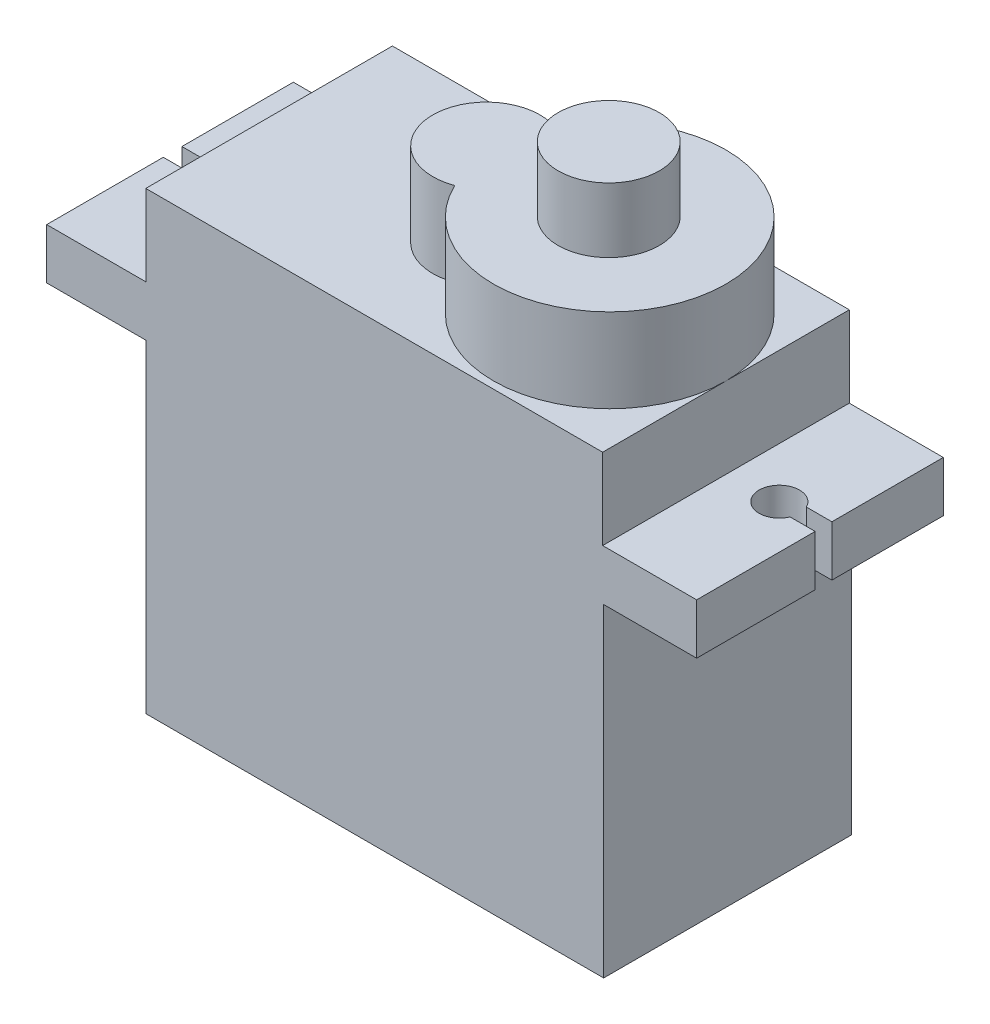
ISO-10303-21;
HEADER;
FILE_DESCRIPTION(('STEP AP214'),'2;1');
FILE_NAME('part.step','',(''),(''),'','','');
FILE_SCHEMA(('AUTOMOTIVE_DESIGN { 1 0 10303 214 1 1 1 1 }'));
ENDSEC;
DATA;
#1=APPLICATION_CONTEXT('core data for automotive mechanical design processes');
#2=APPLICATION_PROTOCOL_DEFINITION('international standard','automotive_design',2000,#1);
#3=PRODUCT_CONTEXT('',#1,'mechanical');
#4=PRODUCT('Part','Part','',(#3));
#5=PRODUCT_RELATED_PRODUCT_CATEGORY('part','',(#4));
#6=PRODUCT_DEFINITION_FORMATION('','',#4);
#7=PRODUCT_DEFINITION_CONTEXT('part definition',#1,'design');
#8=PRODUCT_DEFINITION('design','',#6,#7);
#9=PRODUCT_DEFINITION_SHAPE('','',#8);
#10=(LENGTH_UNIT() NAMED_UNIT(*) SI_UNIT(.MILLI.,.METRE.));
#11=(NAMED_UNIT(*) PLANE_ANGLE_UNIT() SI_UNIT($,.RADIAN.));
#12=(NAMED_UNIT(*) SI_UNIT($,.STERADIAN.) SOLID_ANGLE_UNIT());
#13=UNCERTAINTY_MEASURE_WITH_UNIT(LENGTH_MEASURE(1.E-05),#10,'distance_accuracy_value','');
#14=(GEOMETRIC_REPRESENTATION_CONTEXT(3) GLOBAL_UNCERTAINTY_ASSIGNED_CONTEXT((#13)) GLOBAL_UNIT_ASSIGNED_CONTEXT((#10,
#11,#12)) REPRESENTATION_CONTEXT('',''));
#15=CARTESIAN_POINT('',(0.,0.,0.));
#16=DIRECTION('',(0.,0.,1.));
#17=DIRECTION('',(1.,0.,0.));
#18=AXIS2_PLACEMENT_3D('',#15,#16,#17);
#19=CARTESIAN_POINT('',(-4.9,18.5,-12.2));
#20=DIRECTION('',(1.,0.,0.));
#21=DIRECTION('',(0.,0.,-1.));
#22=AXIS2_PLACEMENT_3D('',#19,#20,#21);
#23=PLANE('',#22);
#24=DIRECTION('',(0.,0.,1.));
#25=VECTOR('',#24,1.);
#26=CARTESIAN_POINT('',(-4.9,18.5,-12.2));
#27=LINE('',#26,#25);
#28=CARTESIAN_POINT('',(-4.9,18.5,-5.76614308058071));
#29=VERTEX_POINT('',#28);
#30=CARTESIAN_POINT('',(-4.9,18.5,0.));
#31=VERTEX_POINT('',#30);
#32=EDGE_CURVE('E301',#29,#31,#27,.T.);
#33=ORIENTED_EDGE('',*,*,#32,.F.);
#34=DIRECTION('',(0.,-1.,0.));
#35=VECTOR('',#34,1.);
#36=CARTESIAN_POINT('',(-4.9,18.5,-5.76614308058071));
#37=LINE('',#36,#35);
#38=CARTESIAN_POINT('',(-4.9,16.,-5.76614308058071));
#39=VERTEX_POINT('',#38);
#40=EDGE_CURVE('E43',#29,#39,#37,.T.);
#41=ORIENTED_EDGE('',*,*,#40,.T.);
#42=DIRECTION('',(0.,0.,1.));
#43=VECTOR('',#42,1.);
#44=CARTESIAN_POINT('',(-4.9,16.,-12.2));
#45=LINE('',#44,#43);
#46=CARTESIAN_POINT('',(-4.9,16.,0.));
#47=VERTEX_POINT('',#46);
#48=EDGE_CURVE('E298',#39,#47,#45,.T.);
#49=ORIENTED_EDGE('',*,*,#48,.T.);
#50=DIRECTION('',(0.,-1.,0.));
#51=VECTOR('',#50,1.);
#52=CARTESIAN_POINT('',(-4.9,18.5,0.));
#53=LINE('',#52,#51);
#54=EDGE_CURVE('E336',#31,#47,#53,.T.);
#55=ORIENTED_EDGE('',*,*,#54,.F.);
#56=EDGE_LOOP('',(#33,#41,#49,#55));
#57=FACE_BOUND('',#56,.T.);
#58=ADVANCED_FACE('F35',(#57),#23,.F.);
#59=CARTESIAN_POINT('',(27.25,18.5,-12.2));
#60=DIRECTION('',(-1.,0.,0.));
#61=DIRECTION('',(0.,0.,1.));
#62=AXIS2_PLACEMENT_3D('',#59,#60,#61);
#63=PLANE('',#62);
#64=DIRECTION('',(0.,0.,-1.));
#65=VECTOR('',#64,1.);
#66=CARTESIAN_POINT('',(27.25,16.,-12.2));
#67=LINE('',#66,#65);
#68=CARTESIAN_POINT('',(27.25,16.,0.));
#69=VERTEX_POINT('',#68);
#70=CARTESIAN_POINT('',(27.25,16.,-5.8618812347987));
#71=VERTEX_POINT('',#70);
#72=EDGE_CURVE('E320',#69,#71,#67,.T.);
#73=ORIENTED_EDGE('',*,*,#72,.T.);
#74=DIRECTION('',(0.,1.,0.));
#75=VECTOR('',#74,1.);
#76=CARTESIAN_POINT('',(27.25,0.,-5.8618812347987));
#77=LINE('',#76,#75);
#78=CARTESIAN_POINT('',(27.25,18.5,-5.8618812347987));
#79=VERTEX_POINT('',#78);
#80=EDGE_CURVE('E208',#71,#79,#77,.T.);
#81=ORIENTED_EDGE('',*,*,#80,.T.);
#82=DIRECTION('',(0.,0.,-1.));
#83=VECTOR('',#82,1.);
#84=CARTESIAN_POINT('',(27.25,18.5,-12.2));
#85=LINE('',#84,#83);
#86=CARTESIAN_POINT('',(27.25,18.5,0.));
#87=VERTEX_POINT('',#86);
#88=EDGE_CURVE('E305',#87,#79,#85,.T.);
#89=ORIENTED_EDGE('',*,*,#88,.F.);
#90=DIRECTION('',(0.,-1.,0.));
#91=VECTOR('',#90,1.);
#92=CARTESIAN_POINT('',(27.25,18.5,0.));
#93=LINE('',#92,#91);
#94=EDGE_CURVE('E333',#87,#69,#93,.T.);
#95=ORIENTED_EDGE('',*,*,#94,.T.);
#96=EDGE_LOOP('',(#73,#81,#89,#95));
#97=FACE_BOUND('',#96,.T.);
#98=ADVANCED_FACE('F398',(#97),#63,.F.);
#99=CARTESIAN_POINT('',(0.,18.5,0.));
#100=DIRECTION('',(0.,1.,0.));
#101=DIRECTION('',(0.,0.,1.));
#102=AXIS2_PLACEMENT_3D('',#99,#100,#101);
#103=PLANE('',#102);
#104=DIRECTION('',(1.,0.,0.));
#105=VECTOR('',#104,1.);
#106=CARTESIAN_POINT('',(-3.61568609473696,18.5,-5.76614308058071));
#107=LINE('',#106,#105);
#108=CARTESIAN_POINT('',(-3.61568609473696,18.5,-5.76614308058071));
#109=VERTEX_POINT('',#108);
#110=EDGE_CURVE('E199',#29,#109,#107,.T.);
#111=ORIENTED_EDGE('',*,*,#110,.F.);
#112=ORIENTED_EDGE('',*,*,#32,.T.);
#113=DIRECTION('',(1.,0.,0.));
#114=VECTOR('',#113,1.);
#115=CARTESIAN_POINT('',(-4.9,18.5,0.));
#116=LINE('',#115,#114);
#117=CARTESIAN_POINT('',(0.,18.5,0.));
#118=VERTEX_POINT('',#117);
#119=EDGE_CURVE('E302',#31,#118,#116,.T.);
#120=ORIENTED_EDGE('',*,*,#119,.T.);
#121=DIRECTION('',(0.,0.,1.));
#122=VECTOR('',#121,1.);
#123=CARTESIAN_POINT('',(0.,18.5,0.));
#124=LINE('',#123,#122);
#125=CARTESIAN_POINT('',(0.,18.5,-12.2));
#126=VERTEX_POINT('',#125);
#127=EDGE_CURVE('E269',#126,#118,#124,.T.);
#128=ORIENTED_EDGE('',*,*,#127,.F.);
#129=DIRECTION('',(-1.,0.,0.));
#130=VECTOR('',#129,1.);
#131=CARTESIAN_POINT('',(-4.9,18.5,-12.2));
#132=LINE('',#131,#130);
#133=CARTESIAN_POINT('',(-4.9,18.5,-12.2));
#134=VERTEX_POINT('',#133);
#135=EDGE_CURVE('E308',#126,#134,#132,.T.);
#136=ORIENTED_EDGE('',*,*,#135,.T.);
#137=CARTESIAN_POINT('',(-4.9,18.5,-6.68905616893845));
#138=VERTEX_POINT('',#137);
#139=EDGE_CURVE('E213',#134,#138,#27,.T.);
#140=ORIENTED_EDGE('',*,*,#139,.T.);
#141=DIRECTION('',(-1.,0.,0.));
#142=VECTOR('',#141,1.);
#143=CARTESIAN_POINT('',(-3.63798194970226,18.5,-6.68905616893845));
#144=LINE('',#143,#142);
#145=CARTESIAN_POINT('',(-3.63798194970226,18.5,-6.68905616893845));
#146=VERTEX_POINT('',#145);
#147=EDGE_CURVE('E50',#146,#138,#144,.T.);
#148=ORIENTED_EDGE('',*,*,#147,.F.);
#149=CARTESIAN_POINT('',(-2.74,18.5,-6.24902387693146));
#150=DIRECTION('',(0.,1.,0.));
#151=DIRECTION('',(0.,0.,1.));
#152=AXIS2_PLACEMENT_3D('',#149,#150,#151);
#153=CIRCLE('',#152,1.);
#154=EDGE_CURVE('E202',#109,#146,#153,.T.);
#155=ORIENTED_EDGE('',*,*,#154,.F.);
#156=EDGE_LOOP('',(#111,#112,#120,#128,#136,#140,#148,#155));
#157=FACE_BOUND('',#156,.T.);
#158=ADVANCED_FACE('F211',(#157),#103,.T.);
#159=CARTESIAN_POINT('',(0.,16.,0.));
#160=DIRECTION('',(0.,-1.,0.));
#161=DIRECTION('',(0.,0.,-1.));
#162=AXIS2_PLACEMENT_3D('',#159,#160,#161);
#163=PLANE('',#162);
#164=DIRECTION('',(-1.,0.,0.));
#165=VECTOR('',#164,1.);
#166=CARTESIAN_POINT('',(-4.9,16.,-12.2));
#167=LINE('',#166,#165);
#168=CARTESIAN_POINT('',(22.65,16.,-12.2));
#169=VERTEX_POINT('',#168);
#170=CARTESIAN_POINT('',(0.,16.,-12.2));
#171=VERTEX_POINT('',#170);
#172=EDGE_CURVE('E327',#169,#171,#167,.T.);
#173=ORIENTED_EDGE('',*,*,#172,.F.);
#174=DIRECTION('',(0.,0.,-1.));
#175=VECTOR('',#174,1.);
#176=CARTESIAN_POINT('',(22.65,16.,0.));
#177=LINE('',#176,#175);
#178=CARTESIAN_POINT('',(22.65,16.,-12.25));
#179=VERTEX_POINT('',#178);
#180=EDGE_CURVE('E342',#169,#179,#177,.T.);
#181=ORIENTED_EDGE('',*,*,#180,.T.);
#182=DIRECTION('',(-1.,0.,0.));
#183=VECTOR('',#182,1.);
#184=CARTESIAN_POINT('',(0.,16.,-12.25));
#185=LINE('',#184,#183);
#186=CARTESIAN_POINT('',(0.,16.,-12.25));
#187=VERTEX_POINT('',#186);
#188=EDGE_CURVE('E347',#179,#187,#185,.T.);
#189=ORIENTED_EDGE('',*,*,#188,.T.);
#190=DIRECTION('',(0.,0.,1.));
#191=VECTOR('',#190,1.);
#192=CARTESIAN_POINT('',(0.,16.,0.));
#193=LINE('',#192,#191);
#194=EDGE_CURVE('E340',#187,#171,#193,.T.);
#195=ORIENTED_EDGE('',*,*,#194,.T.);
#196=EDGE_LOOP('',(#173,#181,#189,#195));
#197=FACE_BOUND('',#196,.T.);
#198=ADVANCED_FACE('F543',(#197),#163,.F.);
#199=CARTESIAN_POINT('',(0.,16.,0.));
#200=DIRECTION('',(1.,0.,0.));
#201=DIRECTION('',(0.,0.,-1.));
#202=AXIS2_PLACEMENT_3D('',#199,#200,#201);
#203=PLANE('',#202);
#204=DIRECTION('',(0.,0.,1.));
#205=VECTOR('',#204,1.);
#206=CARTESIAN_POINT('',(0.,0.,0.));
#207=LINE('',#206,#205);
#208=CARTESIAN_POINT('',(0.,0.,-12.25));
#209=VERTEX_POINT('',#208);
#210=CARTESIAN_POINT('',(0.,0.,0.));
#211=VERTEX_POINT('',#210);
#212=EDGE_CURVE('E339',#209,#211,#207,.T.);
#213=ORIENTED_EDGE('',*,*,#212,.T.);
#214=DIRECTION('',(0.,-1.,0.));
#215=VECTOR('',#214,1.);
#216=CARTESIAN_POINT('',(0.,16.,0.));
#217=LINE('',#216,#215);
#218=CARTESIAN_POINT('',(0.,16.,0.));
#219=VERTEX_POINT('',#218);
#220=EDGE_CURVE('E366',#219,#211,#217,.T.);
#221=ORIENTED_EDGE('',*,*,#220,.F.);
#222=EDGE_CURVE('E343',#171,#219,#193,.T.);
#223=ORIENTED_EDGE('',*,*,#222,.F.);
#224=ORIENTED_EDGE('',*,*,#194,.F.);
#225=DIRECTION('',(0.,-1.,0.));
#226=VECTOR('',#225,1.);
#227=CARTESIAN_POINT('',(0.,16.,-12.25));
#228=LINE('',#227,#226);
#229=EDGE_CURVE('E349',#187,#209,#228,.T.);
#230=ORIENTED_EDGE('',*,*,#229,.T.);
#231=EDGE_LOOP('',(#213,#221,#223,#224,#230));
#232=FACE_BOUND('',#231,.T.);
#233=ADVANCED_FACE('F37',(#232),#203,.F.);
#234=CARTESIAN_POINT('',(0.,16.,0.));
#235=DIRECTION('',(0.,0.,-1.));
#236=DIRECTION('',(-1.,0.,0.));
#237=AXIS2_PLACEMENT_3D('',#234,#235,#236);
#238=PLANE('',#237);
#239=DIRECTION('',(1.,0.,0.));
#240=VECTOR('',#239,1.);
#241=CARTESIAN_POINT('',(0.,0.,0.));
#242=LINE('',#241,#240);
#243=CARTESIAN_POINT('',(22.65,0.,0.));
#244=VERTEX_POINT('',#243);
#245=EDGE_CURVE('E352',#211,#244,#242,.T.);
#246=ORIENTED_EDGE('',*,*,#245,.T.);
#247=DIRECTION('',(0.,-1.,0.));
#248=VECTOR('',#247,1.);
#249=CARTESIAN_POINT('',(22.65,16.,0.));
#250=LINE('',#249,#248);
#251=CARTESIAN_POINT('',(22.65,16.,0.));
#252=VERTEX_POINT('',#251);
#253=EDGE_CURVE('E363',#252,#244,#250,.T.);
#254=ORIENTED_EDGE('',*,*,#253,.F.);
#255=DIRECTION('',(1.,0.,0.));
#256=VECTOR('',#255,1.);
#257=CARTESIAN_POINT('',(-4.9,16.,0.));
#258=LINE('',#257,#256);
#259=EDGE_CURVE('E315',#252,#69,#258,.T.);
#260=ORIENTED_EDGE('',*,*,#259,.T.);
#261=ORIENTED_EDGE('',*,*,#94,.F.);
#262=CARTESIAN_POINT('',(22.6,18.5,0.));
#263=VERTEX_POINT('',#262);
#264=EDGE_CURVE('E300',#263,#87,#116,.T.);
#265=ORIENTED_EDGE('',*,*,#264,.F.);
#266=DIRECTION('',(0.,-1.,0.));
#267=VECTOR('',#266,1.);
#268=CARTESIAN_POINT('',(22.6,22.5,0.));
#269=LINE('',#268,#267);
#270=CARTESIAN_POINT('',(22.6,22.5,0.));
#271=VERTEX_POINT('',#270);
#272=EDGE_CURVE('E292',#271,#263,#269,.T.);
#273=ORIENTED_EDGE('',*,*,#272,.F.);
#274=DIRECTION('',(1.,0.,0.));
#275=VECTOR('',#274,1.);
#276=CARTESIAN_POINT('',(0.,22.5,0.));
#277=LINE('',#276,#275);
#278=CARTESIAN_POINT('',(0.,22.5,0.));
#279=VERTEX_POINT('',#278);
#280=EDGE_CURVE('E273',#279,#271,#277,.T.);
#281=ORIENTED_EDGE('',*,*,#280,.F.);
#282=DIRECTION('',(0.,-1.,0.));
#283=VECTOR('',#282,1.);
#284=CARTESIAN_POINT('',(0.,22.5,0.));
#285=LINE('',#284,#283);
#286=EDGE_CURVE('E295',#279,#118,#285,.T.);
#287=ORIENTED_EDGE('',*,*,#286,.T.);
#288=ORIENTED_EDGE('',*,*,#119,.F.);
#289=ORIENTED_EDGE('',*,*,#54,.T.);
#290=EDGE_CURVE('E316',#47,#219,#258,.T.);
#291=ORIENTED_EDGE('',*,*,#290,.T.);
#292=ORIENTED_EDGE('',*,*,#220,.T.);
#293=EDGE_LOOP('',(#246,#254,#260,#261,#265,#273,#281,#287,#288,#289,#291,#292));
#294=FACE_BOUND('',#293,.T.);
#295=ADVANCED_FACE('F384',(#294),#238,.F.);
#296=CARTESIAN_POINT('',(22.65,16.,0.));
#297=DIRECTION('',(-1.,0.,0.));
#298=DIRECTION('',(0.,0.,1.));
#299=AXIS2_PLACEMENT_3D('',#296,#297,#298);
#300=PLANE('',#299);
#301=DIRECTION('',(0.,0.,-1.));
#302=VECTOR('',#301,1.);
#303=CARTESIAN_POINT('',(22.65,0.,0.));
#304=LINE('',#303,#302);
#305=CARTESIAN_POINT('',(22.65,0.,-12.25));
#306=VERTEX_POINT('',#305);
#307=EDGE_CURVE('E354',#244,#306,#304,.T.);
#308=ORIENTED_EDGE('',*,*,#307,.T.);
#309=DIRECTION('',(0.,-1.,0.));
#310=VECTOR('',#309,1.);
#311=CARTESIAN_POINT('',(22.65,16.,-12.25));
#312=LINE('',#311,#310);
#313=EDGE_CURVE('E360',#179,#306,#312,.T.);
#314=ORIENTED_EDGE('',*,*,#313,.F.);
#315=ORIENTED_EDGE('',*,*,#180,.F.);
#316=EDGE_CURVE('E344',#252,#169,#177,.T.);
#317=ORIENTED_EDGE('',*,*,#316,.F.);
#318=ORIENTED_EDGE('',*,*,#253,.T.);
#319=EDGE_LOOP('',(#308,#314,#315,#317,#318));
#320=FACE_BOUND('',#319,.T.);
#321=ADVANCED_FACE('F588',(#320),#300,.F.);
#322=CARTESIAN_POINT('',(0.,16.,-12.25));
#323=DIRECTION('',(0.,0.,1.));
#324=DIRECTION('',(1.,0.,0.));
#325=AXIS2_PLACEMENT_3D('',#322,#323,#324);
#326=PLANE('',#325);
#327=DIRECTION('',(-1.,0.,0.));
#328=VECTOR('',#327,1.);
#329=CARTESIAN_POINT('',(0.,0.,-12.25));
#330=LINE('',#329,#328);
#331=EDGE_CURVE('E356',#306,#209,#330,.T.);
#332=ORIENTED_EDGE('',*,*,#331,.T.);
#333=ORIENTED_EDGE('',*,*,#229,.F.);
#334=ORIENTED_EDGE('',*,*,#188,.F.);
#335=ORIENTED_EDGE('',*,*,#313,.T.);
#336=EDGE_LOOP('',(#332,#333,#334,#335));
#337=FACE_BOUND('',#336,.T.);
#338=ADVANCED_FACE('F601',(#337),#326,.F.);
#339=CARTESIAN_POINT('',(0.,0.,0.));
#340=DIRECTION('',(0.,-1.,0.));
#341=DIRECTION('',(0.,0.,-1.));
#342=AXIS2_PLACEMENT_3D('',#339,#340,#341);
#343=PLANE('',#342);
#344=ORIENTED_EDGE('',*,*,#212,.F.);
#345=ORIENTED_EDGE('',*,*,#331,.F.);
#346=ORIENTED_EDGE('',*,*,#307,.F.);
#347=ORIENTED_EDGE('',*,*,#245,.F.);
#348=EDGE_LOOP('',(#344,#345,#346,#347));
#349=FACE_BOUND('',#348,.T.);
#350=ADVANCED_FACE('F471',(#349),#343,.T.);
#351=CARTESIAN_POINT('',(0.,16.,0.));
#352=DIRECTION('',(0.,1.,0.));
#353=DIRECTION('',(0.,0.,1.));
#354=AXIS2_PLACEMENT_3D('',#351,#352,#353);
#355=PLANE('',#354);
#356=ORIENTED_EDGE('',*,*,#48,.F.);
#357=DIRECTION('',(1.,0.,0.));
#358=VECTOR('',#357,1.);
#359=CARTESIAN_POINT('',(0.,16.,-5.7661430805807));
#360=LINE('',#359,#358);
#361=CARTESIAN_POINT('',(-3.61568609473696,16.,-5.76614308058071));
#362=VERTEX_POINT('',#361);
#363=EDGE_CURVE('E242',#39,#362,#360,.T.);
#364=ORIENTED_EDGE('',*,*,#363,.T.);
#365=CARTESIAN_POINT('',(-2.74,16.,-6.24902387693146));
#366=DIRECTION('',(0.,1.,0.));
#367=DIRECTION('',(0.,0.,1.));
#368=AXIS2_PLACEMENT_3D('',#365,#366,#367);
#369=CIRCLE('',#368,1.);
#370=CARTESIAN_POINT('',(-3.63798194970226,16.,-6.68905616893845));
#371=VERTEX_POINT('',#370);
#372=EDGE_CURVE('E11',#362,#371,#369,.T.);
#373=ORIENTED_EDGE('',*,*,#372,.T.);
#374=DIRECTION('',(-1.,0.,0.));
#375=VECTOR('',#374,1.);
#376=CARTESIAN_POINT('',(0.,16.,-6.68905616893845));
#377=LINE('',#376,#375);
#378=CARTESIAN_POINT('',(-4.9,16.,-6.68905616893845));
#379=VERTEX_POINT('',#378);
#380=EDGE_CURVE('E196',#371,#379,#377,.T.);
#381=ORIENTED_EDGE('',*,*,#380,.T.);
#382=CARTESIAN_POINT('',(-4.9,16.,-12.2));
#383=VERTEX_POINT('',#382);
#384=EDGE_CURVE('E312',#383,#379,#45,.T.);
#385=ORIENTED_EDGE('',*,*,#384,.F.);
#386=EDGE_CURVE('E323',#171,#383,#167,.T.);
#387=ORIENTED_EDGE('',*,*,#386,.F.);
#388=ORIENTED_EDGE('',*,*,#222,.T.);
#389=ORIENTED_EDGE('',*,*,#290,.F.);
#390=EDGE_LOOP('',(#356,#364,#373,#381,#385,#387,#388,#389));
#391=FACE_BOUND('',#390,.T.);
#392=ADVANCED_FACE('F378',(#391),#355,.F.);
#393=CARTESIAN_POINT('',(25.09,16.,-6.24902387693146));
#394=DIRECTION('',(0.,1.,0.));
#395=DIRECTION('',(0.,0.,1.));
#396=AXIS2_PLACEMENT_3D('',#393,#394,#395);
#397=CIRCLE('',#396,1.);
#398=CARTESIAN_POINT('',(25.9879819497023,16.,-6.68905616893845));
#399=VERTEX_POINT('',#398);
#400=CARTESIAN_POINT('',(26.0120198341915,16.,-5.8618812347987));
#401=VERTEX_POINT('',#400);
#402=EDGE_CURVE('E235',#399,#401,#397,.T.);
#403=ORIENTED_EDGE('',*,*,#402,.T.);
#404=DIRECTION('',(1.,0.,0.));
#405=VECTOR('',#404,1.);
#406=CARTESIAN_POINT('',(0.,16.,-5.8618812347987));
#407=LINE('',#406,#405);
#408=EDGE_CURVE('E238',#401,#71,#407,.T.);
#409=ORIENTED_EDGE('',*,*,#408,.T.);
#410=ORIENTED_EDGE('',*,*,#72,.F.);
#411=ORIENTED_EDGE('',*,*,#259,.F.);
#412=ORIENTED_EDGE('',*,*,#316,.T.);
#413=CARTESIAN_POINT('',(27.25,16.,-12.2));
#414=VERTEX_POINT('',#413);
#415=EDGE_CURVE('E324',#414,#169,#167,.T.);
#416=ORIENTED_EDGE('',*,*,#415,.F.);
#417=CARTESIAN_POINT('',(27.25,16.,-6.68905616893845));
#418=VERTEX_POINT('',#417);
#419=EDGE_CURVE('E319',#418,#414,#67,.T.);
#420=ORIENTED_EDGE('',*,*,#419,.F.);
#421=DIRECTION('',(-1.,0.,0.));
#422=VECTOR('',#421,1.);
#423=CARTESIAN_POINT('',(0.,16.,-6.68905616893845));
#424=LINE('',#423,#422);
#425=EDGE_CURVE('E217',#418,#399,#424,.T.);
#426=ORIENTED_EDGE('',*,*,#425,.T.);
#427=EDGE_LOOP('',(#403,#409,#410,#411,#412,#416,#420,#426));
#428=FACE_BOUND('',#427,.T.);
#429=ADVANCED_FACE('F409',(#428),#355,.F.);
#430=ORIENTED_EDGE('',*,*,#384,.T.);
#431=DIRECTION('',(0.,1.,0.));
#432=VECTOR('',#431,1.);
#433=CARTESIAN_POINT('',(-4.9,18.5,-6.68905616893845));
#434=LINE('',#433,#432);
#435=EDGE_CURVE('E369',#379,#138,#434,.T.);
#436=ORIENTED_EDGE('',*,*,#435,.T.);
#437=ORIENTED_EDGE('',*,*,#139,.F.);
#438=DIRECTION('',(0.,-1.,0.));
#439=VECTOR('',#438,1.);
#440=CARTESIAN_POINT('',(-4.9,18.5,-12.2));
#441=LINE('',#440,#439);
#442=EDGE_CURVE('E311',#134,#383,#441,.T.);
#443=ORIENTED_EDGE('',*,*,#442,.T.);
#444=EDGE_LOOP('',(#430,#436,#437,#443));
#445=FACE_BOUND('',#444,.T.);
#446=ADVANCED_FACE('F400',(#445),#23,.F.);
#447=CARTESIAN_POINT('',(27.25,18.5,-6.68905616893845));
#448=VERTEX_POINT('',#447);
#449=CARTESIAN_POINT('',(27.25,18.5,-12.2));
#450=VERTEX_POINT('',#449);
#451=EDGE_CURVE('E304',#448,#450,#85,.T.);
#452=ORIENTED_EDGE('',*,*,#451,.F.);
#453=DIRECTION('',(0.,1.,0.));
#454=VECTOR('',#453,1.);
#455=CARTESIAN_POINT('',(27.25,0.,-6.68905616893845));
#456=LINE('',#455,#454);
#457=EDGE_CURVE('E58',#418,#448,#456,.T.);
#458=ORIENTED_EDGE('',*,*,#457,.F.);
#459=ORIENTED_EDGE('',*,*,#419,.T.);
#460=DIRECTION('',(0.,-1.,0.));
#461=VECTOR('',#460,1.);
#462=CARTESIAN_POINT('',(27.25,18.5,-12.2));
#463=LINE('',#462,#461);
#464=EDGE_CURVE('E330',#450,#414,#463,.T.);
#465=ORIENTED_EDGE('',*,*,#464,.F.);
#466=EDGE_LOOP('',(#452,#458,#459,#465));
#467=FACE_BOUND('',#466,.T.);
#468=ADVANCED_FACE('F406',(#467),#63,.F.);
#469=CARTESIAN_POINT('',(-4.9,18.5,-12.2));
#470=DIRECTION('',(0.,0.,1.));
#471=DIRECTION('',(1.,0.,0.));
#472=AXIS2_PLACEMENT_3D('',#469,#470,#471);
#473=PLANE('',#472);
#474=ORIENTED_EDGE('',*,*,#415,.T.);
#475=ORIENTED_EDGE('',*,*,#172,.T.);
#476=ORIENTED_EDGE('',*,*,#386,.T.);
#477=ORIENTED_EDGE('',*,*,#442,.F.);
#478=ORIENTED_EDGE('',*,*,#135,.F.);
#479=DIRECTION('',(0.,-1.,0.));
#480=VECTOR('',#479,1.);
#481=CARTESIAN_POINT('',(0.,22.5,-12.2));
#482=LINE('',#481,#480);
#483=CARTESIAN_POINT('',(0.,22.5,-12.2));
#484=VERTEX_POINT('',#483);
#485=EDGE_CURVE('E282',#484,#126,#482,.T.);
#486=ORIENTED_EDGE('',*,*,#485,.F.);
#487=DIRECTION('',(-1.,0.,0.));
#488=VECTOR('',#487,1.);
#489=CARTESIAN_POINT('',(0.,22.5,-12.2));
#490=LINE('',#489,#488);
#491=CARTESIAN_POINT('',(22.6,22.5,-12.2));
#492=VERTEX_POINT('',#491);
#493=EDGE_CURVE('E280',#492,#484,#490,.T.);
#494=ORIENTED_EDGE('',*,*,#493,.F.);
#495=DIRECTION('',(0.,-1.,0.));
#496=VECTOR('',#495,1.);
#497=CARTESIAN_POINT('',(22.6,22.5,-12.2));
#498=LINE('',#497,#496);
#499=CARTESIAN_POINT('',(22.6,18.5,-12.2));
#500=VERTEX_POINT('',#499);
#501=EDGE_CURVE('E289',#492,#500,#498,.T.);
#502=ORIENTED_EDGE('',*,*,#501,.T.);
#503=EDGE_CURVE('E309',#450,#500,#132,.T.);
#504=ORIENTED_EDGE('',*,*,#503,.F.);
#505=ORIENTED_EDGE('',*,*,#464,.T.);
#506=EDGE_LOOP('',(#474,#475,#476,#477,#478,#486,#494,#502,#504,#505));
#507=FACE_BOUND('',#506,.T.);
#508=ADVANCED_FACE('F415',(#507),#473,.F.);
#509=DIRECTION('',(1.,0.,0.));
#510=VECTOR('',#509,1.);
#511=CARTESIAN_POINT('',(26.0120198341915,18.5,-5.8618812347987));
#512=LINE('',#511,#510);
#513=CARTESIAN_POINT('',(26.0120198341915,18.5,-5.8618812347987));
#514=VERTEX_POINT('',#513);
#515=EDGE_CURVE('E224',#514,#79,#512,.T.);
#516=ORIENTED_EDGE('',*,*,#515,.F.);
#517=CARTESIAN_POINT('',(25.09,18.5,-6.24902387693146));
#518=DIRECTION('',(0.,1.,0.));
#519=DIRECTION('',(0.,0.,1.));
#520=AXIS2_PLACEMENT_3D('',#517,#518,#519);
#521=CIRCLE('',#520,1.);
#522=CARTESIAN_POINT('',(25.9879819497023,18.5,-6.68905616893845));
#523=VERTEX_POINT('',#522);
#524=EDGE_CURVE('E221',#523,#514,#521,.T.);
#525=ORIENTED_EDGE('',*,*,#524,.F.);
#526=DIRECTION('',(-1.,0.,0.));
#527=VECTOR('',#526,1.);
#528=CARTESIAN_POINT('',(25.9879819497023,18.5,-6.68905616893845));
#529=LINE('',#528,#527);
#530=EDGE_CURVE('E219',#448,#523,#529,.T.);
#531=ORIENTED_EDGE('',*,*,#530,.F.);
#532=ORIENTED_EDGE('',*,*,#451,.T.);
#533=ORIENTED_EDGE('',*,*,#503,.T.);
#534=DIRECTION('',(0.,0.,-1.));
#535=VECTOR('',#534,1.);
#536=CARTESIAN_POINT('',(22.6,18.5,0.));
#537=LINE('',#536,#535);
#538=EDGE_CURVE('E274',#263,#500,#537,.T.);
#539=ORIENTED_EDGE('',*,*,#538,.F.);
#540=ORIENTED_EDGE('',*,*,#264,.T.);
#541=ORIENTED_EDGE('',*,*,#88,.T.);
#542=EDGE_LOOP('',(#516,#525,#531,#532,#533,#539,#540,#541));
#543=FACE_BOUND('',#542,.T.);
#544=ADVANCED_FACE('F465',(#543),#103,.T.);
#545=CARTESIAN_POINT('',(0.,22.5,0.));
#546=DIRECTION('',(1.,0.,0.));
#547=DIRECTION('',(0.,0.,-1.));
#548=AXIS2_PLACEMENT_3D('',#545,#546,#547);
#549=PLANE('',#548);
#550=ORIENTED_EDGE('',*,*,#127,.T.);
#551=ORIENTED_EDGE('',*,*,#286,.F.);
#552=DIRECTION('',(0.,0.,1.));
#553=VECTOR('',#552,1.);
#554=CARTESIAN_POINT('',(0.,22.5,0.));
#555=LINE('',#554,#553);
#556=EDGE_CURVE('E270',#484,#279,#555,.T.);
#557=ORIENTED_EDGE('',*,*,#556,.F.);
#558=ORIENTED_EDGE('',*,*,#485,.T.);
#559=EDGE_LOOP('',(#550,#551,#557,#558));
#560=FACE_BOUND('',#559,.T.);
#561=ADVANCED_FACE('F461',(#560),#549,.F.);
#562=CARTESIAN_POINT('',(22.6,22.5,0.));
#563=DIRECTION('',(-1.,0.,0.));
#564=DIRECTION('',(0.,0.,1.));
#565=AXIS2_PLACEMENT_3D('',#562,#563,#564);
#566=PLANE('',#565);
#567=ORIENTED_EDGE('',*,*,#538,.T.);
#568=ORIENTED_EDGE('',*,*,#501,.F.);
#569=DIRECTION('',(0.,0.,-1.));
#570=VECTOR('',#569,1.);
#571=CARTESIAN_POINT('',(22.6,22.5,0.));
#572=LINE('',#571,#570);
#573=CARTESIAN_POINT('',(22.6,22.5,-6.09999999999999));
#574=VERTEX_POINT('',#573);
#575=EDGE_CURVE('E276',#574,#492,#572,.T.);
#576=ORIENTED_EDGE('',*,*,#575,.F.);
#577=EDGE_CURVE('E277',#271,#574,#572,.T.);
#578=ORIENTED_EDGE('',*,*,#577,.F.);
#579=ORIENTED_EDGE('',*,*,#272,.T.);
#580=EDGE_LOOP('',(#567,#568,#576,#578,#579));
#581=FACE_BOUND('',#580,.T.);
#582=ADVANCED_FACE('F458',(#581),#566,.F.);
#583=CARTESIAN_POINT('',(0.,22.5,0.));
#584=DIRECTION('',(0.,-1.,0.));
#585=DIRECTION('',(0.,0.,-1.));
#586=AXIS2_PLACEMENT_3D('',#583,#584,#585);
#587=PLANE('',#586);
#588=CARTESIAN_POINT('',(10.75,22.5,-6.09999999999999));
#589=DIRECTION('',(0.,1.,0.));
#590=DIRECTION('',(0.,0.,1.));
#591=AXIS2_PLACEMENT_3D('',#588,#589,#590);
#592=CIRCLE('',#591,2.65);
#593=CARTESIAN_POINT('',(11.6655737704918,22.5,-8.5868101396744));
#594=VERTEX_POINT('',#593);
#595=CARTESIAN_POINT('',(11.6655737704918,22.5,-3.61318986032559));
#596=VERTEX_POINT('',#595);
#597=EDGE_CURVE('E249',#594,#596,#592,.T.);
#598=ORIENTED_EDGE('',*,*,#597,.F.);
#599=CARTESIAN_POINT('',(16.85,22.5,-6.09999999999999));
#600=DIRECTION('',(0.,1.,0.));
#601=DIRECTION('',(0.,0.,1.));
#602=AXIS2_PLACEMENT_3D('',#599,#600,#601);
#603=CIRCLE('',#602,5.75);
#604=EDGE_CURVE('E263',#574,#594,#603,.T.);
#605=ORIENTED_EDGE('',*,*,#604,.F.);
#606=ORIENTED_EDGE('',*,*,#575,.T.);
#607=ORIENTED_EDGE('',*,*,#493,.T.);
#608=ORIENTED_EDGE('',*,*,#556,.T.);
#609=ORIENTED_EDGE('',*,*,#280,.T.);
#610=ORIENTED_EDGE('',*,*,#577,.T.);
#611=EDGE_CURVE('E256',#596,#574,#603,.T.);
#612=ORIENTED_EDGE('',*,*,#611,.F.);
#613=EDGE_LOOP('',(#598,#605,#606,#607,#608,#609,#610,#612));
#614=FACE_BOUND('',#613,.T.);
#615=ADVANCED_FACE('F455',(#614),#587,.F.);
#616=CARTESIAN_POINT('',(10.75,26.65,-6.09999999999999));
#617=DIRECTION('',(0.,-1.,0.));
#618=DIRECTION('',(0.,0.,-1.));
#619=AXIS2_PLACEMENT_3D('',#616,#617,#618);
#620=CYLINDRICAL_SURFACE('',#619,2.65);
#621=ORIENTED_EDGE('',*,*,#597,.T.);
#622=DIRECTION('',(0.,-1.,0.));
#623=VECTOR('',#622,1.);
#624=CARTESIAN_POINT('',(11.6655737704918,26.65,-3.61318986032559));
#625=LINE('',#624,#623);
#626=CARTESIAN_POINT('',(11.6655737704918,26.65,-3.61318986032559));
#627=VERTEX_POINT('',#626);
#628=EDGE_CURVE('E266',#627,#596,#625,.T.);
#629=ORIENTED_EDGE('',*,*,#628,.F.);
#630=CARTESIAN_POINT('',(10.75,26.65,-6.09999999999999));
#631=DIRECTION('',(0.,1.,0.));
#632=DIRECTION('',(0.,0.,1.));
#633=AXIS2_PLACEMENT_3D('',#630,#631,#632);
#634=CIRCLE('',#633,2.65);
#635=CARTESIAN_POINT('',(11.6655737704918,26.65,-8.5868101396744));
#636=VERTEX_POINT('',#635);
#637=EDGE_CURVE('E252',#636,#627,#634,.T.);
#638=ORIENTED_EDGE('',*,*,#637,.F.);
#639=DIRECTION('',(0.,-1.,0.));
#640=VECTOR('',#639,1.);
#641=CARTESIAN_POINT('',(11.6655737704918,26.65,-8.5868101396744));
#642=LINE('',#641,#640);
#643=EDGE_CURVE('E258',#636,#594,#642,.T.);
#644=ORIENTED_EDGE('',*,*,#643,.T.);
#645=EDGE_LOOP('',(#621,#629,#638,#644));
#646=FACE_BOUND('',#645,.T.);
#647=ADVANCED_FACE('F434',(#646),#620,.T.);
#648=CARTESIAN_POINT('',(16.85,26.65,-6.09999999999999));
#649=DIRECTION('',(0.,-1.,0.));
#650=DIRECTION('',(0.,0.,-1.));
#651=AXIS2_PLACEMENT_3D('',#648,#649,#650);
#652=CYLINDRICAL_SURFACE('',#651,5.75);
#653=ORIENTED_EDGE('',*,*,#611,.T.);
#654=ORIENTED_EDGE('',*,*,#604,.T.);
#655=ORIENTED_EDGE('',*,*,#643,.F.);
#656=CARTESIAN_POINT('',(16.85,26.65,-6.09999999999999));
#657=DIRECTION('',(0.,1.,0.));
#658=DIRECTION('',(0.,0.,1.));
#659=AXIS2_PLACEMENT_3D('',#656,#657,#658);
#660=CIRCLE('',#659,5.75);
#661=EDGE_CURVE('E255',#627,#636,#660,.T.);
#662=ORIENTED_EDGE('',*,*,#661,.F.);
#663=ORIENTED_EDGE('',*,*,#628,.T.);
#664=EDGE_LOOP('',(#653,#654,#655,#662,#663));
#665=FACE_BOUND('',#664,.T.);
#666=ADVANCED_FACE('F429',(#665),#652,.T.);
#667=CARTESIAN_POINT('',(13.8,26.65,-6.09999999999999));
#668=DIRECTION('',(0.,1.,0.));
#669=DIRECTION('',(0.,0.,1.));
#670=AXIS2_PLACEMENT_3D('',#667,#668,#669);
#671=PLANE('',#670);
#672=CARTESIAN_POINT('',(16.8,26.65,-6.09999999999999));
#673=DIRECTION('',(0.,1.,0.));
#674=DIRECTION('',(0.,0.,1.));
#675=AXIS2_PLACEMENT_3D('',#672,#673,#674);
#676=CIRCLE('',#675,2.5);
#677=CARTESIAN_POINT('',(16.8,26.65,-3.6));
#678=VERTEX_POINT('',#677);
#679=EDGE_CURVE('E245',#678,#678,#676,.T.);
#680=ORIENTED_EDGE('',*,*,#679,.F.);
#681=EDGE_LOOP('',(#680));
#682=FACE_BOUND('',#681,.T.);
#683=ORIENTED_EDGE('',*,*,#637,.T.);
#684=ORIENTED_EDGE('',*,*,#661,.T.);
#685=EDGE_LOOP('',(#683,#684));
#686=FACE_BOUND('',#685,.T.);
#687=ADVANCED_FACE('F437',(#682,#686),#671,.T.);
#688=CARTESIAN_POINT('',(16.8,29.85,-6.09999999999999));
#689=DIRECTION('',(0.,-1.,0.));
#690=DIRECTION('',(0.,0.,-1.));
#691=AXIS2_PLACEMENT_3D('',#688,#689,#690);
#692=CYLINDRICAL_SURFACE('',#691,2.5);
#693=CARTESIAN_POINT('',(16.8,29.85,-6.09999999999999));
#694=DIRECTION('',(0.,1.,0.));
#695=DIRECTION('',(0.,0.,1.));
#696=AXIS2_PLACEMENT_3D('',#693,#694,#695);
#697=CIRCLE('',#696,2.5);
#698=CARTESIAN_POINT('',(16.8,29.85,-3.6));
#699=VERTEX_POINT('',#698);
#700=EDGE_CURVE('E246',#699,#699,#697,.T.);
#701=ORIENTED_EDGE('',*,*,#700,.F.);
#702=EDGE_LOOP('',(#701));
#703=FACE_BOUND('',#702,.T.);
#704=ORIENTED_EDGE('',*,*,#679,.T.);
#705=EDGE_LOOP('',(#704));
#706=FACE_BOUND('',#705,.T.);
#707=ADVANCED_FACE('F439',(#703,#706),#692,.T.);
#708=CARTESIAN_POINT('',(16.8,29.85,-6.09999999999999));
#709=DIRECTION('',(0.,1.,0.));
#710=DIRECTION('',(0.,0.,1.));
#711=AXIS2_PLACEMENT_3D('',#708,#709,#710);
#712=PLANE('',#711);
#713=ORIENTED_EDGE('',*,*,#700,.T.);
#714=EDGE_LOOP('',(#713));
#715=FACE_BOUND('',#714,.T.);
#716=ADVANCED_FACE('F446',(#715),#712,.T.);
#717=CARTESIAN_POINT('',(26.0120198341915,0.,-5.8618812347987));
#718=DIRECTION('',(0.,0.,1.));
#719=DIRECTION('',(1.,0.,0.));
#720=AXIS2_PLACEMENT_3D('',#717,#718,#719);
#721=PLANE('',#720);
#722=DIRECTION('',(0.,1.,0.));
#723=VECTOR('',#722,1.);
#724=CARTESIAN_POINT('',(26.0120198341915,0.,-5.8618812347987));
#725=LINE('',#724,#723);
#726=EDGE_CURVE('E228',#401,#514,#725,.T.);
#727=ORIENTED_EDGE('',*,*,#726,.T.);
#728=ORIENTED_EDGE('',*,*,#515,.T.);
#729=ORIENTED_EDGE('',*,*,#80,.F.);
#730=ORIENTED_EDGE('',*,*,#408,.F.);
#731=EDGE_LOOP('',(#727,#728,#729,#730));
#732=FACE_BOUND('',#731,.T.);
#733=ADVANCED_FACE('F521',(#732),#721,.F.);
#734=CARTESIAN_POINT('',(25.09,0.,-6.24902387693146));
#735=DIRECTION('',(0.,1.,0.));
#736=DIRECTION('',(0.,0.,1.));
#737=AXIS2_PLACEMENT_3D('',#734,#735,#736);
#738=CYLINDRICAL_SURFACE('',#737,1.);
#739=DIRECTION('',(0.,1.,0.));
#740=VECTOR('',#739,1.);
#741=CARTESIAN_POINT('',(25.9879819497023,0.,-6.68905616893845));
#742=LINE('',#741,#740);
#743=EDGE_CURVE('E230',#399,#523,#742,.T.);
#744=ORIENTED_EDGE('',*,*,#743,.T.);
#745=ORIENTED_EDGE('',*,*,#524,.T.);
#746=ORIENTED_EDGE('',*,*,#726,.F.);
#747=ORIENTED_EDGE('',*,*,#402,.F.);
#748=EDGE_LOOP('',(#744,#745,#746,#747));
#749=FACE_BOUND('',#748,.T.);
#750=ADVANCED_FACE('F662',(#749),#738,.F.);
#751=CARTESIAN_POINT('',(25.9879819497023,0.,-6.68905616893845));
#752=DIRECTION('',(0.,0.,-1.));
#753=DIRECTION('',(-1.,0.,0.));
#754=AXIS2_PLACEMENT_3D('',#751,#752,#753);
#755=PLANE('',#754);
#756=ORIENTED_EDGE('',*,*,#457,.T.);
#757=ORIENTED_EDGE('',*,*,#530,.T.);
#758=ORIENTED_EDGE('',*,*,#743,.F.);
#759=ORIENTED_EDGE('',*,*,#425,.F.);
#760=EDGE_LOOP('',(#756,#757,#758,#759));
#761=FACE_BOUND('',#760,.T.);
#762=ADVANCED_FACE('F395',(#761),#755,.F.);
#763=CARTESIAN_POINT('',(-2.74,0.,-6.24902387693146));
#764=DIRECTION('',(0.,1.,0.));
#765=DIRECTION('',(0.,0.,1.));
#766=AXIS2_PLACEMENT_3D('',#763,#764,#765);
#767=CYLINDRICAL_SURFACE('',#766,1.);
#768=DIRECTION('',(0.,1.,0.));
#769=VECTOR('',#768,1.);
#770=CARTESIAN_POINT('',(-3.61568609473696,0.,-5.76614308058071));
#771=LINE('',#770,#769);
#772=EDGE_CURVE('E198',#362,#109,#771,.T.);
#773=ORIENTED_EDGE('',*,*,#772,.T.);
#774=ORIENTED_EDGE('',*,*,#154,.T.);
#775=DIRECTION('',(0.,1.,0.));
#776=VECTOR('',#775,1.);
#777=CARTESIAN_POINT('',(-3.63798194970226,0.,-6.68905616893845));
#778=LINE('',#777,#776);
#779=EDGE_CURVE('E192',#371,#146,#778,.T.);
#780=ORIENTED_EDGE('',*,*,#779,.F.);
#781=ORIENTED_EDGE('',*,*,#372,.F.);
#782=EDGE_LOOP('',(#773,#774,#780,#781));
#783=FACE_BOUND('',#782,.T.);
#784=ADVANCED_FACE('F203',(#783),#767,.F.);
#785=CARTESIAN_POINT('',(-3.61568609473696,0.,-5.76614308058071));
#786=DIRECTION('',(0.,0.,1.));
#787=DIRECTION('',(1.,0.,0.));
#788=AXIS2_PLACEMENT_3D('',#785,#786,#787);
#789=PLANE('',#788);
#790=ORIENTED_EDGE('',*,*,#40,.F.);
#791=ORIENTED_EDGE('',*,*,#110,.T.);
#792=ORIENTED_EDGE('',*,*,#772,.F.);
#793=ORIENTED_EDGE('',*,*,#363,.F.);
#794=EDGE_LOOP('',(#790,#791,#792,#793));
#795=FACE_BOUND('',#794,.T.);
#796=ADVANCED_FACE('F387',(#795),#789,.F.);
#797=CARTESIAN_POINT('',(-3.63798194970226,0.,-6.68905616893845));
#798=DIRECTION('',(0.,0.,-1.));
#799=DIRECTION('',(-1.,0.,0.));
#800=AXIS2_PLACEMENT_3D('',#797,#798,#799);
#801=PLANE('',#800);
#802=ORIENTED_EDGE('',*,*,#779,.T.);
#803=ORIENTED_EDGE('',*,*,#147,.T.);
#804=ORIENTED_EDGE('',*,*,#435,.F.);
#805=ORIENTED_EDGE('',*,*,#380,.F.);
#806=EDGE_LOOP('',(#802,#803,#804,#805));
#807=FACE_BOUND('',#806,.T.);
#808=ADVANCED_FACE('F194',(#807),#801,.F.);
#809=CLOSED_SHELL('',(#58,#98,#158,#198,#233,#295,#321,#338,#350,#392,#429,#446,#468,#508,#544,
#561,#582,#615,#647,#666,#687,#707,#716,#733,#750,#762,#784,#796,#808));
#810=MANIFOLD_SOLID_BREP('B2',#809);
#811=ADVANCED_BREP_SHAPE_REPRESENTATION('',(#18,#810),#14);
#812=SHAPE_DEFINITION_REPRESENTATION(#9,#811);
ENDSEC;
END-ISO-10303-21;
